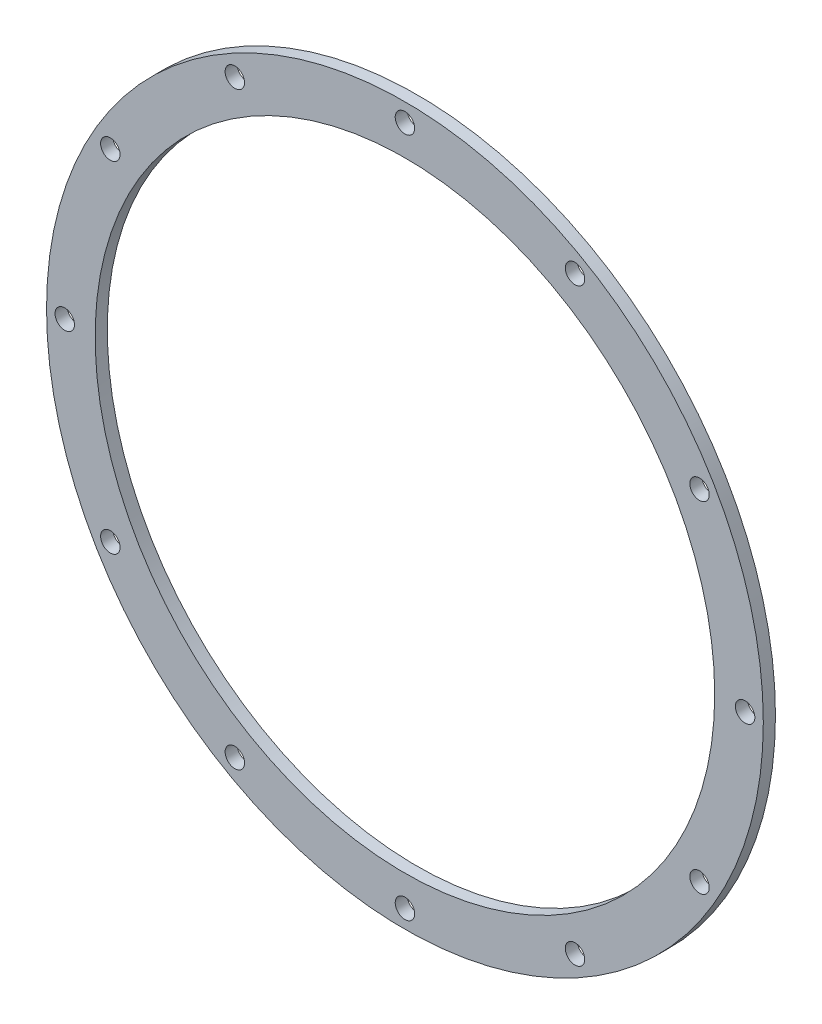
ISO-10303-21;
HEADER;
FILE_DESCRIPTION(('STEP AP214'),'2;1');
FILE_NAME('part.step','',(''),(''),'','','');
FILE_SCHEMA(('AUTOMOTIVE_DESIGN { 1 0 10303 214 1 1 1 1 }'));
ENDSEC;
DATA;
#1=APPLICATION_CONTEXT('core data for automotive mechanical design processes');
#2=APPLICATION_PROTOCOL_DEFINITION('international standard','automotive_design',2000,#1);
#3=PRODUCT_CONTEXT('',#1,'mechanical');
#4=PRODUCT('Part','Part','',(#3));
#5=PRODUCT_RELATED_PRODUCT_CATEGORY('part','',(#4));
#6=PRODUCT_DEFINITION_FORMATION('','',#4);
#7=PRODUCT_DEFINITION_CONTEXT('part definition',#1,'design');
#8=PRODUCT_DEFINITION('design','',#6,#7);
#9=PRODUCT_DEFINITION_SHAPE('','',#8);
#10=(LENGTH_UNIT() NAMED_UNIT(*) SI_UNIT(.MILLI.,.METRE.));
#11=(NAMED_UNIT(*) PLANE_ANGLE_UNIT() SI_UNIT($,.RADIAN.));
#12=(NAMED_UNIT(*) SI_UNIT($,.STERADIAN.) SOLID_ANGLE_UNIT());
#13=UNCERTAINTY_MEASURE_WITH_UNIT(LENGTH_MEASURE(1.E-05),#10,'distance_accuracy_value','');
#14=(GEOMETRIC_REPRESENTATION_CONTEXT(3) GLOBAL_UNCERTAINTY_ASSIGNED_CONTEXT((#13)) GLOBAL_UNIT_ASSIGNED_CONTEXT((#10,
#11,#12)) REPRESENTATION_CONTEXT('',''));
#15=CARTESIAN_POINT('',(0.,0.,0.));
#16=DIRECTION('',(0.,0.,1.));
#17=DIRECTION('',(1.,0.,0.));
#18=AXIS2_PLACEMENT_3D('',#15,#16,#17);
#19=CARTESIAN_POINT('',(0.,0.,2.));
#20=DIRECTION('',(0.,0.,1.));
#21=DIRECTION('',(1.,0.,0.));
#22=AXIS2_PLACEMENT_3D('',#19,#20,#21);
#23=PLANE('',#22);
#24=CARTESIAN_POINT('',(-48.4974226119286,28.,2.));
#25=DIRECTION('',(0.,0.,1.));
#26=DIRECTION('',(1.,0.,0.));
#27=AXIS2_PLACEMENT_3D('',#24,#25,#26);
#28=CIRCLE('',#27,1.6);
#29=CARTESIAN_POINT('',(-46.8974226119286,28.,2.));
#30=VERTEX_POINT('',#29);
#31=EDGE_CURVE('E108',#30,#30,#28,.T.);
#32=ORIENTED_EDGE('',*,*,#31,.F.);
#33=EDGE_LOOP('',(#32));
#34=FACE_BOUND('',#33,.T.);
#35=CARTESIAN_POINT('',(-48.4974226119286,-28.,2.));
#36=DIRECTION('',(0.,0.,1.));
#37=DIRECTION('',(1.,0.,0.));
#38=AXIS2_PLACEMENT_3D('',#35,#36,#37);
#39=CIRCLE('',#38,1.6);
#40=CARTESIAN_POINT('',(-46.8974226119286,-28.,2.));
#41=VERTEX_POINT('',#40);
#42=EDGE_CURVE('E96',#41,#41,#39,.T.);
#43=ORIENTED_EDGE('',*,*,#42,.F.);
#44=EDGE_LOOP('',(#43));
#45=FACE_BOUND('',#44,.T.);
#46=CARTESIAN_POINT('',(0.,-56.,2.));
#47=DIRECTION('',(0.,0.,1.));
#48=DIRECTION('',(1.,0.,0.));
#49=AXIS2_PLACEMENT_3D('',#46,#47,#48);
#50=CIRCLE('',#49,1.6);
#51=CARTESIAN_POINT('',(1.60000000000001,-56.,2.));
#52=VERTEX_POINT('',#51);
#53=EDGE_CURVE('E84',#52,#52,#50,.T.);
#54=ORIENTED_EDGE('',*,*,#53,.F.);
#55=EDGE_LOOP('',(#54));
#56=FACE_BOUND('',#55,.T.);
#57=CARTESIAN_POINT('',(48.4974226119286,-28.,2.));
#58=DIRECTION('',(0.,0.,1.));
#59=DIRECTION('',(1.,0.,0.));
#60=AXIS2_PLACEMENT_3D('',#57,#58,#59);
#61=CIRCLE('',#60,1.60000000000019);
#62=CARTESIAN_POINT('',(50.0974226119288,-28.,2.));
#63=VERTEX_POINT('',#62);
#64=EDGE_CURVE('E72',#63,#63,#61,.T.);
#65=ORIENTED_EDGE('',*,*,#64,.F.);
#66=EDGE_LOOP('',(#65));
#67=FACE_BOUND('',#66,.T.);
#68=CARTESIAN_POINT('',(48.4974226119286,28.,2.));
#69=DIRECTION('',(0.,0.,1.));
#70=DIRECTION('',(1.,0.,0.));
#71=AXIS2_PLACEMENT_3D('',#68,#69,#70);
#72=CIRCLE('',#71,1.60000000000009);
#73=CARTESIAN_POINT('',(50.0974226119286,28.,2.));
#74=VERTEX_POINT('',#73);
#75=EDGE_CURVE('E60',#74,#74,#72,.T.);
#76=ORIENTED_EDGE('',*,*,#75,.F.);
#77=EDGE_LOOP('',(#76));
#78=FACE_BOUND('',#77,.T.);
#79=CARTESIAN_POINT('',(0.,56.,2.));
#80=DIRECTION('',(0.,0.,1.));
#81=DIRECTION('',(1.,0.,0.));
#82=AXIS2_PLACEMENT_3D('',#79,#80,#81);
#83=CIRCLE('',#82,1.6);
#84=CARTESIAN_POINT('',(1.6,56.,2.));
#85=VERTEX_POINT('',#84);
#86=EDGE_CURVE('E48',#85,#85,#83,.T.);
#87=ORIENTED_EDGE('',*,*,#86,.F.);
#88=EDGE_LOOP('',(#87));
#89=FACE_BOUND('',#88,.T.);
#90=CARTESIAN_POINT('',(0.,0.,2.));
#91=DIRECTION('',(0.,0.,1.));
#92=DIRECTION('',(1.,0.,0.));
#93=AXIS2_PLACEMENT_3D('',#90,#91,#92);
#94=CIRCLE('',#93,59.);
#95=CARTESIAN_POINT('',(59.,0.,2.));
#96=VERTEX_POINT('',#95);
#97=EDGE_CURVE('E10',#96,#96,#94,.T.);
#98=ORIENTED_EDGE('',*,*,#97,.T.);
#99=EDGE_LOOP('',(#98));
#100=FACE_BOUND('',#99,.T.);
#101=CARTESIAN_POINT('',(0.,0.,2.));
#102=DIRECTION('',(0.,0.,1.));
#103=DIRECTION('',(1.,0.,0.));
#104=AXIS2_PLACEMENT_3D('',#101,#102,#103);
#105=CIRCLE('',#104,51.);
#106=CARTESIAN_POINT('',(51.,0.,2.));
#107=VERTEX_POINT('',#106);
#108=EDGE_CURVE('E43',#107,#107,#105,.T.);
#109=ORIENTED_EDGE('',*,*,#108,.F.);
#110=EDGE_LOOP('',(#109));
#111=FACE_BOUND('',#110,.T.);
#112=CARTESIAN_POINT('',(28.,48.4974226119286,2.));
#113=DIRECTION('',(0.,0.,1.));
#114=DIRECTION('',(1.,0.,0.));
#115=AXIS2_PLACEMENT_3D('',#112,#113,#114);
#116=CIRCLE('',#115,1.6);
#117=CARTESIAN_POINT('',(29.6,48.4974226119286,2.));
#118=VERTEX_POINT('',#117);
#119=EDGE_CURVE('E54',#118,#118,#116,.T.);
#120=ORIENTED_EDGE('',*,*,#119,.F.);
#121=EDGE_LOOP('',(#120));
#122=FACE_BOUND('',#121,.T.);
#123=CARTESIAN_POINT('',(56.,0.,2.));
#124=DIRECTION('',(0.,0.,1.));
#125=DIRECTION('',(1.,0.,0.));
#126=AXIS2_PLACEMENT_3D('',#123,#124,#125);
#127=CIRCLE('',#126,1.60000000000014);
#128=CARTESIAN_POINT('',(57.6000000000001,0.,2.));
#129=VERTEX_POINT('',#128);
#130=EDGE_CURVE('E66',#129,#129,#127,.T.);
#131=ORIENTED_EDGE('',*,*,#130,.F.);
#132=EDGE_LOOP('',(#131));
#133=FACE_BOUND('',#132,.T.);
#134=CARTESIAN_POINT('',(28.,-48.4974226119286,2.));
#135=DIRECTION('',(0.,0.,1.));
#136=DIRECTION('',(1.,0.,0.));
#137=AXIS2_PLACEMENT_3D('',#134,#135,#136);
#138=CIRCLE('',#137,1.6);
#139=CARTESIAN_POINT('',(29.6,-48.4974226119286,2.));
#140=VERTEX_POINT('',#139);
#141=EDGE_CURVE('E78',#140,#140,#138,.T.);
#142=ORIENTED_EDGE('',*,*,#141,.F.);
#143=EDGE_LOOP('',(#142));
#144=FACE_BOUND('',#143,.T.);
#145=CARTESIAN_POINT('',(-28.,-48.4974226119286,2.));
#146=DIRECTION('',(0.,0.,1.));
#147=DIRECTION('',(1.,0.,0.));
#148=AXIS2_PLACEMENT_3D('',#145,#146,#147);
#149=CIRCLE('',#148,1.6);
#150=CARTESIAN_POINT('',(-26.4,-48.4974226119286,2.));
#151=VERTEX_POINT('',#150);
#152=EDGE_CURVE('E90',#151,#151,#149,.T.);
#153=ORIENTED_EDGE('',*,*,#152,.F.);
#154=EDGE_LOOP('',(#153));
#155=FACE_BOUND('',#154,.T.);
#156=CARTESIAN_POINT('',(-56.,0.,2.));
#157=DIRECTION('',(0.,0.,1.));
#158=DIRECTION('',(1.,0.,0.));
#159=AXIS2_PLACEMENT_3D('',#156,#157,#158);
#160=CIRCLE('',#159,1.6);
#161=CARTESIAN_POINT('',(-54.4,0.,2.));
#162=VERTEX_POINT('',#161);
#163=EDGE_CURVE('E102',#162,#162,#160,.T.);
#164=ORIENTED_EDGE('',*,*,#163,.F.);
#165=EDGE_LOOP('',(#164));
#166=FACE_BOUND('',#165,.T.);
#167=CARTESIAN_POINT('',(-28.,48.4974226119285,2.));
#168=DIRECTION('',(0.,0.,1.));
#169=DIRECTION('',(1.,0.,0.));
#170=AXIS2_PLACEMENT_3D('',#167,#168,#169);
#171=CIRCLE('',#170,1.6);
#172=CARTESIAN_POINT('',(-26.4,48.4974226119285,2.));
#173=VERTEX_POINT('',#172);
#174=EDGE_CURVE('E114',#173,#173,#171,.T.);
#175=ORIENTED_EDGE('',*,*,#174,.F.);
#176=EDGE_LOOP('',(#175));
#177=FACE_BOUND('',#176,.T.);
#178=ADVANCED_FACE('F32',(#34,#45,#56,#67,#78,#89,#100,#111,#122,#133,#144,#155,#166,#177),#23,.T.);
#179=CARTESIAN_POINT('',(0.,0.,0.));
#180=DIRECTION('',(0.,0.,1.));
#181=DIRECTION('',(1.,0.,0.));
#182=AXIS2_PLACEMENT_3D('',#179,#180,#181);
#183=PLANE('',#182);
#184=CARTESIAN_POINT('',(0.,0.,0.));
#185=DIRECTION('',(0.,0.,1.));
#186=DIRECTION('',(1.,0.,0.));
#187=AXIS2_PLACEMENT_3D('',#184,#185,#186);
#188=CIRCLE('',#187,59.);
#189=CARTESIAN_POINT('',(59.,0.,0.));
#190=VERTEX_POINT('',#189);
#191=EDGE_CURVE('E36',#190,#190,#188,.T.);
#192=ORIENTED_EDGE('',*,*,#191,.F.);
#193=EDGE_LOOP('',(#192));
#194=FACE_BOUND('',#193,.T.);
#195=CARTESIAN_POINT('',(0.,0.,0.));
#196=DIRECTION('',(0.,0.,1.));
#197=DIRECTION('',(1.,0.,0.));
#198=AXIS2_PLACEMENT_3D('',#195,#196,#197);
#199=CIRCLE('',#198,51.);
#200=CARTESIAN_POINT('',(51.,0.,0.));
#201=VERTEX_POINT('',#200);
#202=EDGE_CURVE('E45',#201,#201,#199,.T.);
#203=ORIENTED_EDGE('',*,*,#202,.T.);
#204=EDGE_LOOP('',(#203));
#205=FACE_BOUND('',#204,.T.);
#206=CARTESIAN_POINT('',(0.,56.,0.));
#207=DIRECTION('',(0.,0.,1.));
#208=DIRECTION('',(1.,0.,0.));
#209=AXIS2_PLACEMENT_3D('',#206,#207,#208);
#210=CIRCLE('',#209,1.6);
#211=CARTESIAN_POINT('',(1.6,56.,0.));
#212=VERTEX_POINT('',#211);
#213=EDGE_CURVE('E51',#212,#212,#210,.T.);
#214=ORIENTED_EDGE('',*,*,#213,.T.);
#215=EDGE_LOOP('',(#214));
#216=FACE_BOUND('',#215,.T.);
#217=CARTESIAN_POINT('',(28.,48.4974226119286,0.));
#218=DIRECTION('',(0.,0.,1.));
#219=DIRECTION('',(1.,0.,0.));
#220=AXIS2_PLACEMENT_3D('',#217,#218,#219);
#221=CIRCLE('',#220,1.6);
#222=CARTESIAN_POINT('',(29.6,48.4974226119286,0.));
#223=VERTEX_POINT('',#222);
#224=EDGE_CURVE('E57',#223,#223,#221,.T.);
#225=ORIENTED_EDGE('',*,*,#224,.T.);
#226=EDGE_LOOP('',(#225));
#227=FACE_BOUND('',#226,.T.);
#228=CARTESIAN_POINT('',(48.4974226119286,28.,0.));
#229=DIRECTION('',(0.,0.,1.));
#230=DIRECTION('',(1.,0.,0.));
#231=AXIS2_PLACEMENT_3D('',#228,#229,#230);
#232=CIRCLE('',#231,1.60000000000009);
#233=CARTESIAN_POINT('',(50.0974226119286,28.,0.));
#234=VERTEX_POINT('',#233);
#235=EDGE_CURVE('E63',#234,#234,#232,.T.);
#236=ORIENTED_EDGE('',*,*,#235,.T.);
#237=EDGE_LOOP('',(#236));
#238=FACE_BOUND('',#237,.T.);
#239=CARTESIAN_POINT('',(56.,0.,0.));
#240=DIRECTION('',(0.,0.,1.));
#241=DIRECTION('',(1.,0.,0.));
#242=AXIS2_PLACEMENT_3D('',#239,#240,#241);
#243=CIRCLE('',#242,1.60000000000014);
#244=CARTESIAN_POINT('',(57.6000000000001,0.,0.));
#245=VERTEX_POINT('',#244);
#246=EDGE_CURVE('E69',#245,#245,#243,.T.);
#247=ORIENTED_EDGE('',*,*,#246,.T.);
#248=EDGE_LOOP('',(#247));
#249=FACE_BOUND('',#248,.T.);
#250=CARTESIAN_POINT('',(48.4974226119286,-28.,0.));
#251=DIRECTION('',(0.,0.,1.));
#252=DIRECTION('',(1.,0.,0.));
#253=AXIS2_PLACEMENT_3D('',#250,#251,#252);
#254=CIRCLE('',#253,1.60000000000019);
#255=CARTESIAN_POINT('',(50.0974226119288,-28.,0.));
#256=VERTEX_POINT('',#255);
#257=EDGE_CURVE('E75',#256,#256,#254,.T.);
#258=ORIENTED_EDGE('',*,*,#257,.T.);
#259=EDGE_LOOP('',(#258));
#260=FACE_BOUND('',#259,.T.);
#261=CARTESIAN_POINT('',(28.,-48.4974226119286,0.));
#262=DIRECTION('',(0.,0.,1.));
#263=DIRECTION('',(1.,0.,0.));
#264=AXIS2_PLACEMENT_3D('',#261,#262,#263);
#265=CIRCLE('',#264,1.6);
#266=CARTESIAN_POINT('',(29.6,-48.4974226119286,0.));
#267=VERTEX_POINT('',#266);
#268=EDGE_CURVE('E81',#267,#267,#265,.T.);
#269=ORIENTED_EDGE('',*,*,#268,.T.);
#270=EDGE_LOOP('',(#269));
#271=FACE_BOUND('',#270,.T.);
#272=CARTESIAN_POINT('',(0.,-56.,0.));
#273=DIRECTION('',(0.,0.,1.));
#274=DIRECTION('',(1.,0.,0.));
#275=AXIS2_PLACEMENT_3D('',#272,#273,#274);
#276=CIRCLE('',#275,1.6);
#277=CARTESIAN_POINT('',(1.60000000000001,-56.,0.));
#278=VERTEX_POINT('',#277);
#279=EDGE_CURVE('E87',#278,#278,#276,.T.);
#280=ORIENTED_EDGE('',*,*,#279,.T.);
#281=EDGE_LOOP('',(#280));
#282=FACE_BOUND('',#281,.T.);
#283=CARTESIAN_POINT('',(-28.,-48.4974226119286,0.));
#284=DIRECTION('',(0.,0.,1.));
#285=DIRECTION('',(1.,0.,0.));
#286=AXIS2_PLACEMENT_3D('',#283,#284,#285);
#287=CIRCLE('',#286,1.6);
#288=CARTESIAN_POINT('',(-26.4,-48.4974226119286,0.));
#289=VERTEX_POINT('',#288);
#290=EDGE_CURVE('E93',#289,#289,#287,.T.);
#291=ORIENTED_EDGE('',*,*,#290,.T.);
#292=EDGE_LOOP('',(#291));
#293=FACE_BOUND('',#292,.T.);
#294=CARTESIAN_POINT('',(-48.4974226119286,-28.,0.));
#295=DIRECTION('',(0.,0.,1.));
#296=DIRECTION('',(1.,0.,0.));
#297=AXIS2_PLACEMENT_3D('',#294,#295,#296);
#298=CIRCLE('',#297,1.6);
#299=CARTESIAN_POINT('',(-46.8974226119286,-28.,0.));
#300=VERTEX_POINT('',#299);
#301=EDGE_CURVE('E99',#300,#300,#298,.T.);
#302=ORIENTED_EDGE('',*,*,#301,.T.);
#303=EDGE_LOOP('',(#302));
#304=FACE_BOUND('',#303,.T.);
#305=CARTESIAN_POINT('',(-56.,0.,0.));
#306=DIRECTION('',(0.,0.,1.));
#307=DIRECTION('',(1.,0.,0.));
#308=AXIS2_PLACEMENT_3D('',#305,#306,#307);
#309=CIRCLE('',#308,1.6);
#310=CARTESIAN_POINT('',(-54.4,0.,0.));
#311=VERTEX_POINT('',#310);
#312=EDGE_CURVE('E105',#311,#311,#309,.T.);
#313=ORIENTED_EDGE('',*,*,#312,.T.);
#314=EDGE_LOOP('',(#313));
#315=FACE_BOUND('',#314,.T.);
#316=CARTESIAN_POINT('',(-48.4974226119286,28.,0.));
#317=DIRECTION('',(0.,0.,1.));
#318=DIRECTION('',(1.,0.,0.));
#319=AXIS2_PLACEMENT_3D('',#316,#317,#318);
#320=CIRCLE('',#319,1.6);
#321=CARTESIAN_POINT('',(-46.8974226119286,28.,0.));
#322=VERTEX_POINT('',#321);
#323=EDGE_CURVE('E111',#322,#322,#320,.T.);
#324=ORIENTED_EDGE('',*,*,#323,.T.);
#325=EDGE_LOOP('',(#324));
#326=FACE_BOUND('',#325,.T.);
#327=CARTESIAN_POINT('',(-28.,48.4974226119285,0.));
#328=DIRECTION('',(0.,0.,1.));
#329=DIRECTION('',(1.,0.,0.));
#330=AXIS2_PLACEMENT_3D('',#327,#328,#329);
#331=CIRCLE('',#330,1.6);
#332=CARTESIAN_POINT('',(-26.4,48.4974226119285,0.));
#333=VERTEX_POINT('',#332);
#334=EDGE_CURVE('E117',#333,#333,#331,.T.);
#335=ORIENTED_EDGE('',*,*,#334,.T.);
#336=EDGE_LOOP('',(#335));
#337=FACE_BOUND('',#336,.T.);
#338=ADVANCED_FACE('F127',(#194,#205,#216,#227,#238,#249,#260,#271,#282,#293,#304,#315,#326,
#337),#183,.F.);
#339=CARTESIAN_POINT('',(0.,0.,2.));
#340=DIRECTION('',(0.,0.,-1.));
#341=DIRECTION('',(-1.,0.,0.));
#342=AXIS2_PLACEMENT_3D('',#339,#340,#341);
#343=CYLINDRICAL_SURFACE('',#342,59.);
#344=ORIENTED_EDGE('',*,*,#97,.F.);
#345=EDGE_LOOP('',(#344));
#346=FACE_BOUND('',#345,.T.);
#347=ORIENTED_EDGE('',*,*,#191,.T.);
#348=EDGE_LOOP('',(#347));
#349=FACE_BOUND('',#348,.T.);
#350=ADVANCED_FACE('F34',(#346,#349),#343,.T.);
#351=CARTESIAN_POINT('',(0.,0.,2.));
#352=DIRECTION('',(0.,0.,-1.));
#353=DIRECTION('',(-1.,0.,0.));
#354=AXIS2_PLACEMENT_3D('',#351,#352,#353);
#355=CYLINDRICAL_SURFACE('',#354,51.);
#356=ORIENTED_EDGE('',*,*,#108,.T.);
#357=EDGE_LOOP('',(#356));
#358=FACE_BOUND('',#357,.T.);
#359=ORIENTED_EDGE('',*,*,#202,.F.);
#360=EDGE_LOOP('',(#359));
#361=FACE_BOUND('',#360,.T.);
#362=ADVANCED_FACE('F137',(#358,#361),#355,.F.);
#363=CARTESIAN_POINT('',(0.,56.,2.));
#364=DIRECTION('',(0.,0.,-1.));
#365=DIRECTION('',(-1.,0.,0.));
#366=AXIS2_PLACEMENT_3D('',#363,#364,#365);
#367=CYLINDRICAL_SURFACE('',#366,1.6);
#368=ORIENTED_EDGE('',*,*,#86,.T.);
#369=EDGE_LOOP('',(#368));
#370=FACE_BOUND('',#369,.T.);
#371=ORIENTED_EDGE('',*,*,#213,.F.);
#372=EDGE_LOOP('',(#371));
#373=FACE_BOUND('',#372,.T.);
#374=ADVANCED_FACE('F140',(#370,#373),#367,.F.);
#375=CARTESIAN_POINT('',(28.,48.4974226119286,2.));
#376=DIRECTION('',(0.,0.,-1.));
#377=DIRECTION('',(-1.,0.,0.));
#378=AXIS2_PLACEMENT_3D('',#375,#376,#377);
#379=CYLINDRICAL_SURFACE('',#378,1.6);
#380=ORIENTED_EDGE('',*,*,#119,.T.);
#381=EDGE_LOOP('',(#380));
#382=FACE_BOUND('',#381,.T.);
#383=ORIENTED_EDGE('',*,*,#224,.F.);
#384=EDGE_LOOP('',(#383));
#385=FACE_BOUND('',#384,.T.);
#386=ADVANCED_FACE('F144',(#382,#385),#379,.F.);
#387=CARTESIAN_POINT('',(48.4974226119286,28.,2.));
#388=DIRECTION('',(0.,0.,-1.));
#389=DIRECTION('',(-1.,0.,0.));
#390=AXIS2_PLACEMENT_3D('',#387,#388,#389);
#391=CYLINDRICAL_SURFACE('',#390,1.60000000000009);
#392=ORIENTED_EDGE('',*,*,#75,.T.);
#393=EDGE_LOOP('',(#392));
#394=FACE_BOUND('',#393,.T.);
#395=ORIENTED_EDGE('',*,*,#235,.F.);
#396=EDGE_LOOP('',(#395));
#397=FACE_BOUND('',#396,.T.);
#398=ADVANCED_FACE('F148',(#394,#397),#391,.F.);
#399=CARTESIAN_POINT('',(56.,0.,2.));
#400=DIRECTION('',(0.,0.,-1.));
#401=DIRECTION('',(-1.,0.,0.));
#402=AXIS2_PLACEMENT_3D('',#399,#400,#401);
#403=CYLINDRICAL_SURFACE('',#402,1.60000000000014);
#404=ORIENTED_EDGE('',*,*,#130,.T.);
#405=EDGE_LOOP('',(#404));
#406=FACE_BOUND('',#405,.T.);
#407=ORIENTED_EDGE('',*,*,#246,.F.);
#408=EDGE_LOOP('',(#407));
#409=FACE_BOUND('',#408,.T.);
#410=ADVANCED_FACE('F152',(#406,#409),#403,.F.);
#411=CARTESIAN_POINT('',(48.4974226119286,-28.,2.));
#412=DIRECTION('',(0.,0.,-1.));
#413=DIRECTION('',(-1.,0.,0.));
#414=AXIS2_PLACEMENT_3D('',#411,#412,#413);
#415=CYLINDRICAL_SURFACE('',#414,1.60000000000019);
#416=ORIENTED_EDGE('',*,*,#64,.T.);
#417=EDGE_LOOP('',(#416));
#418=FACE_BOUND('',#417,.T.);
#419=ORIENTED_EDGE('',*,*,#257,.F.);
#420=EDGE_LOOP('',(#419));
#421=FACE_BOUND('',#420,.T.);
#422=ADVANCED_FACE('F156',(#418,#421),#415,.F.);
#423=CARTESIAN_POINT('',(28.,-48.4974226119286,2.));
#424=DIRECTION('',(0.,0.,-1.));
#425=DIRECTION('',(-1.,0.,0.));
#426=AXIS2_PLACEMENT_3D('',#423,#424,#425);
#427=CYLINDRICAL_SURFACE('',#426,1.6);
#428=ORIENTED_EDGE('',*,*,#141,.T.);
#429=EDGE_LOOP('',(#428));
#430=FACE_BOUND('',#429,.T.);
#431=ORIENTED_EDGE('',*,*,#268,.F.);
#432=EDGE_LOOP('',(#431));
#433=FACE_BOUND('',#432,.T.);
#434=ADVANCED_FACE('F160',(#430,#433),#427,.F.);
#435=CARTESIAN_POINT('',(0.,-56.,2.));
#436=DIRECTION('',(0.,0.,-1.));
#437=DIRECTION('',(-1.,0.,0.));
#438=AXIS2_PLACEMENT_3D('',#435,#436,#437);
#439=CYLINDRICAL_SURFACE('',#438,1.6);
#440=ORIENTED_EDGE('',*,*,#53,.T.);
#441=EDGE_LOOP('',(#440));
#442=FACE_BOUND('',#441,.T.);
#443=ORIENTED_EDGE('',*,*,#279,.F.);
#444=EDGE_LOOP('',(#443));
#445=FACE_BOUND('',#444,.T.);
#446=ADVANCED_FACE('F164',(#442,#445),#439,.F.);
#447=CARTESIAN_POINT('',(-28.,-48.4974226119286,2.));
#448=DIRECTION('',(0.,0.,-1.));
#449=DIRECTION('',(-1.,0.,0.));
#450=AXIS2_PLACEMENT_3D('',#447,#448,#449);
#451=CYLINDRICAL_SURFACE('',#450,1.6);
#452=ORIENTED_EDGE('',*,*,#152,.T.);
#453=EDGE_LOOP('',(#452));
#454=FACE_BOUND('',#453,.T.);
#455=ORIENTED_EDGE('',*,*,#290,.F.);
#456=EDGE_LOOP('',(#455));
#457=FACE_BOUND('',#456,.T.);
#458=ADVANCED_FACE('F168',(#454,#457),#451,.F.);
#459=CARTESIAN_POINT('',(-48.4974226119286,-28.,2.));
#460=DIRECTION('',(0.,0.,-1.));
#461=DIRECTION('',(-1.,0.,0.));
#462=AXIS2_PLACEMENT_3D('',#459,#460,#461);
#463=CYLINDRICAL_SURFACE('',#462,1.6);
#464=ORIENTED_EDGE('',*,*,#42,.T.);
#465=EDGE_LOOP('',(#464));
#466=FACE_BOUND('',#465,.T.);
#467=ORIENTED_EDGE('',*,*,#301,.F.);
#468=EDGE_LOOP('',(#467));
#469=FACE_BOUND('',#468,.T.);
#470=ADVANCED_FACE('F172',(#466,#469),#463,.F.);
#471=CARTESIAN_POINT('',(-56.,0.,2.));
#472=DIRECTION('',(0.,0.,-1.));
#473=DIRECTION('',(-1.,0.,0.));
#474=AXIS2_PLACEMENT_3D('',#471,#472,#473);
#475=CYLINDRICAL_SURFACE('',#474,1.6);
#476=ORIENTED_EDGE('',*,*,#163,.T.);
#477=EDGE_LOOP('',(#476));
#478=FACE_BOUND('',#477,.T.);
#479=ORIENTED_EDGE('',*,*,#312,.F.);
#480=EDGE_LOOP('',(#479));
#481=FACE_BOUND('',#480,.T.);
#482=ADVANCED_FACE('F176',(#478,#481),#475,.F.);
#483=CARTESIAN_POINT('',(-48.4974226119286,28.,2.));
#484=DIRECTION('',(0.,0.,-1.));
#485=DIRECTION('',(-1.,0.,0.));
#486=AXIS2_PLACEMENT_3D('',#483,#484,#485);
#487=CYLINDRICAL_SURFACE('',#486,1.6);
#488=ORIENTED_EDGE('',*,*,#31,.T.);
#489=EDGE_LOOP('',(#488));
#490=FACE_BOUND('',#489,.T.);
#491=ORIENTED_EDGE('',*,*,#323,.F.);
#492=EDGE_LOOP('',(#491));
#493=FACE_BOUND('',#492,.T.);
#494=ADVANCED_FACE('F180',(#490,#493),#487,.F.);
#495=CARTESIAN_POINT('',(-28.,48.4974226119285,2.));
#496=DIRECTION('',(0.,0.,-1.));
#497=DIRECTION('',(-1.,0.,0.));
#498=AXIS2_PLACEMENT_3D('',#495,#496,#497);
#499=CYLINDRICAL_SURFACE('',#498,1.6);
#500=ORIENTED_EDGE('',*,*,#174,.T.);
#501=EDGE_LOOP('',(#500));
#502=FACE_BOUND('',#501,.T.);
#503=ORIENTED_EDGE('',*,*,#334,.F.);
#504=EDGE_LOOP('',(#503));
#505=FACE_BOUND('',#504,.T.);
#506=ADVANCED_FACE('F123',(#502,#505),#499,.F.);
#507=CLOSED_SHELL('',(#178,#338,#350,#362,#374,#386,#398,#410,#422,#434,#446,#458,#470,#482,
#494,#506));
#508=MANIFOLD_SOLID_BREP('B2',#507);
#509=ADVANCED_BREP_SHAPE_REPRESENTATION('',(#18,#508),#14);
#510=SHAPE_DEFINITION_REPRESENTATION(#9,#509);
ENDSEC;
END-ISO-10303-21;
